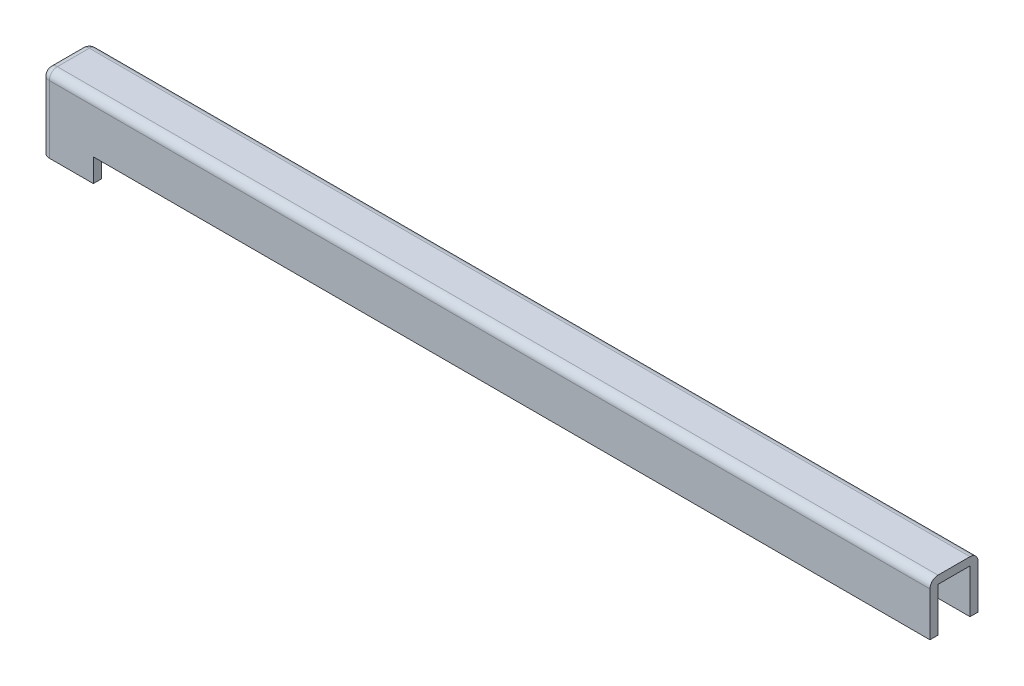
ISO-10303-21;
HEADER;
FILE_DESCRIPTION(('STEP AP214'),'2;1');
FILE_NAME('part.step','',(''),(''),'','','');
FILE_SCHEMA(('AUTOMOTIVE_DESIGN { 1 0 10303 214 1 1 1 1 }'));
ENDSEC;
DATA;
#1=APPLICATION_CONTEXT('core data for automotive mechanical design processes');
#2=APPLICATION_PROTOCOL_DEFINITION('international standard','automotive_design',2000,#1);
#3=PRODUCT_CONTEXT('',#1,'mechanical');
#4=PRODUCT('Part','Part','',(#3));
#5=PRODUCT_RELATED_PRODUCT_CATEGORY('part','',(#4));
#6=PRODUCT_DEFINITION_FORMATION('','',#4);
#7=PRODUCT_DEFINITION_CONTEXT('part definition',#1,'design');
#8=PRODUCT_DEFINITION('design','',#6,#7);
#9=PRODUCT_DEFINITION_SHAPE('','',#8);
#10=(LENGTH_UNIT() NAMED_UNIT(*) SI_UNIT(.MILLI.,.METRE.));
#11=(NAMED_UNIT(*) PLANE_ANGLE_UNIT() SI_UNIT($,.RADIAN.));
#12=(NAMED_UNIT(*) SI_UNIT($,.STERADIAN.) SOLID_ANGLE_UNIT());
#13=UNCERTAINTY_MEASURE_WITH_UNIT(LENGTH_MEASURE(1.E-05),#10,'distance_accuracy_value','');
#14=(GEOMETRIC_REPRESENTATION_CONTEXT(3) GLOBAL_UNCERTAINTY_ASSIGNED_CONTEXT((#13)) GLOBAL_UNIT_ASSIGNED_CONTEXT((#10,
#11,#12)) REPRESENTATION_CONTEXT('',''));
#15=CARTESIAN_POINT('',(0.,0.,0.));
#16=DIRECTION('',(0.,0.,1.));
#17=DIRECTION('',(1.,0.,0.));
#18=AXIS2_PLACEMENT_3D('',#15,#16,#17);
#19=CARTESIAN_POINT('',(220.,0.,0.));
#20=DIRECTION('',(0.,-1.,0.));
#21=DIRECTION('',(0.,0.,-1.));
#22=AXIS2_PLACEMENT_3D('',#19,#20,#21);
#23=PLANE('',#22);
#24=DIRECTION('',(-1.,0.,0.));
#25=VECTOR('',#24,1.);
#26=CARTESIAN_POINT('',(220.,0.,-8.));
#27=LINE('',#26,#25);
#28=CARTESIAN_POINT('',(220.,0.,-8.));
#29=VERTEX_POINT('',#28);
#30=CARTESIAN_POINT('',(11.,0.,-8.));
#31=VERTEX_POINT('',#30);
#32=EDGE_CURVE('E241',#29,#31,#27,.T.);
#33=ORIENTED_EDGE('',*,*,#32,.T.);
#34=DIRECTION('',(0.,0.,-1.));
#35=VECTOR('',#34,1.);
#36=CARTESIAN_POINT('',(11.,0.,0.));
#37=LINE('',#36,#35);
#38=CARTESIAN_POINT('',(11.,0.,-10.));
#39=VERTEX_POINT('',#38);
#40=EDGE_CURVE('E158',#31,#39,#37,.T.);
#41=ORIENTED_EDGE('',*,*,#40,.T.);
#42=DIRECTION('',(-1.,0.,0.));
#43=VECTOR('',#42,1.);
#44=CARTESIAN_POINT('',(220.,0.,-10.));
#45=LINE('',#44,#43);
#46=CARTESIAN_POINT('',(220.,0.,-10.));
#47=VERTEX_POINT('',#46);
#48=EDGE_CURVE('E238',#47,#39,#45,.T.);
#49=ORIENTED_EDGE('',*,*,#48,.F.);
#50=DIRECTION('',(0.,0.,-1.));
#51=VECTOR('',#50,1.);
#52=CARTESIAN_POINT('',(220.,0.,0.));
#53=LINE('',#52,#51);
#54=EDGE_CURVE('E204',#29,#47,#53,.T.);
#55=ORIENTED_EDGE('',*,*,#54,.F.);
#56=EDGE_LOOP('',(#33,#41,#49,#55));
#57=FACE_BOUND('',#56,.T.);
#58=ADVANCED_FACE('F38',(#57),#23,.T.);
#59=CARTESIAN_POINT('',(220.,0.,-8.));
#60=DIRECTION('',(0.,0.,1.));
#61=DIRECTION('',(1.,0.,0.));
#62=AXIS2_PLACEMENT_3D('',#59,#60,#61);
#63=PLANE('',#62);
#64=DIRECTION('',(0.,1.,0.));
#65=VECTOR('',#64,1.);
#66=CARTESIAN_POINT('',(0.,0.,-8.));
#67=LINE('',#66,#65);
#68=CARTESIAN_POINT('',(0.,-5.8,-8.));
#69=VERTEX_POINT('',#68);
#70=CARTESIAN_POINT('',(0.,11.,-8.));
#71=VERTEX_POINT('',#70);
#72=EDGE_CURVE('E160',#69,#71,#67,.T.);
#73=ORIENTED_EDGE('',*,*,#72,.F.);
#74=DIRECTION('',(-1.,0.,0.));
#75=VECTOR('',#74,1.);
#76=CARTESIAN_POINT('',(0.,-5.8,-8.));
#77=LINE('',#76,#75);
#78=CARTESIAN_POINT('',(11.,-5.8,-8.));
#79=VERTEX_POINT('',#78);
#80=EDGE_CURVE('E164',#79,#69,#77,.T.);
#81=ORIENTED_EDGE('',*,*,#80,.F.);
#82=DIRECTION('',(0.,1.,0.));
#83=VECTOR('',#82,1.);
#84=CARTESIAN_POINT('',(11.,-5.8,-8.));
#85=LINE('',#84,#83);
#86=EDGE_CURVE('E152',#79,#31,#85,.T.);
#87=ORIENTED_EDGE('',*,*,#86,.T.);
#88=ORIENTED_EDGE('',*,*,#32,.F.);
#89=DIRECTION('',(0.,1.,0.));
#90=VECTOR('',#89,1.);
#91=CARTESIAN_POINT('',(220.,0.,-8.));
#92=LINE('',#91,#90);
#93=CARTESIAN_POINT('',(220.,11.,-8.));
#94=VERTEX_POINT('',#93);
#95=EDGE_CURVE('E201',#29,#94,#92,.T.);
#96=ORIENTED_EDGE('',*,*,#95,.T.);
#97=DIRECTION('',(-1.,0.,0.));
#98=VECTOR('',#97,1.);
#99=CARTESIAN_POINT('',(220.,11.,-8.));
#100=LINE('',#99,#98);
#101=EDGE_CURVE('E222',#94,#71,#100,.T.);
#102=ORIENTED_EDGE('',*,*,#101,.T.);
#103=EDGE_LOOP('',(#73,#81,#87,#88,#96,#102));
#104=FACE_BOUND('',#103,.T.);
#105=ADVANCED_FACE('F165',(#104),#63,.T.);
#106=CARTESIAN_POINT('',(220.,0.,-10.));
#107=DIRECTION('',(0.,0.,1.));
#108=DIRECTION('',(1.,0.,0.));
#109=AXIS2_PLACEMENT_3D('',#106,#107,#108);
#110=PLANE('',#109);
#111=DIRECTION('',(1.,0.,0.));
#112=VECTOR('',#111,1.);
#113=CARTESIAN_POINT('',(0.,-5.8,-10.));
#114=LINE('',#113,#112);
#115=CARTESIAN_POINT('',(0.,-5.8,-10.));
#116=VERTEX_POINT('',#115);
#117=CARTESIAN_POINT('',(11.,-5.8,-10.));
#118=VERTEX_POINT('',#117);
#119=EDGE_CURVE('E175',#116,#118,#114,.T.);
#120=ORIENTED_EDGE('',*,*,#119,.F.);
#121=DIRECTION('',(0.,-1.,0.));
#122=VECTOR('',#121,1.);
#123=CARTESIAN_POINT('',(0.,0.,-10.));
#124=LINE('',#123,#122);
#125=CARTESIAN_POINT('',(0.,11.,-10.));
#126=VERTEX_POINT('',#125);
#127=EDGE_CURVE('E256',#116,#126,#124,.F.);
#128=ORIENTED_EDGE('',*,*,#127,.T.);
#129=DIRECTION('',(-1.,0.,0.));
#130=VECTOR('',#129,1.);
#131=CARTESIAN_POINT('',(220.,11.,-10.));
#132=LINE('',#131,#130);
#133=CARTESIAN_POINT('',(220.,11.,-10.));
#134=VERTEX_POINT('',#133);
#135=EDGE_CURVE('E254',#126,#134,#132,.F.);
#136=ORIENTED_EDGE('',*,*,#135,.T.);
#137=DIRECTION('',(0.,1.,0.));
#138=VECTOR('',#137,1.);
#139=CARTESIAN_POINT('',(220.,0.,-10.));
#140=LINE('',#139,#138);
#141=EDGE_CURVE('E207',#47,#134,#140,.T.);
#142=ORIENTED_EDGE('',*,*,#141,.F.);
#143=ORIENTED_EDGE('',*,*,#48,.T.);
#144=DIRECTION('',(0.,1.,0.));
#145=VECTOR('',#144,1.);
#146=CARTESIAN_POINT('',(11.,-5.8,-10.));
#147=LINE('',#146,#145);
#148=EDGE_CURVE('E193',#118,#39,#147,.T.);
#149=ORIENTED_EDGE('',*,*,#148,.F.);
#150=EDGE_LOOP('',(#120,#128,#136,#142,#143,#149));
#151=FACE_BOUND('',#150,.T.);
#152=ADVANCED_FACE('F343',(#151),#110,.F.);
#153=CARTESIAN_POINT('',(220.,13.,0.));
#154=DIRECTION('',(0.,1.,0.));
#155=DIRECTION('',(0.,0.,1.));
#156=AXIS2_PLACEMENT_3D('',#153,#154,#155);
#157=PLANE('',#156);
#158=DIRECTION('',(0.,0.,-1.));
#159=VECTOR('',#158,1.);
#160=CARTESIAN_POINT('',(220.,13.,0.));
#161=LINE('',#160,#159);
#162=CARTESIAN_POINT('',(220.,13.,0.));
#163=VERTEX_POINT('',#162);
#164=CARTESIAN_POINT('',(220.,13.,-8.));
#165=VERTEX_POINT('',#164);
#166=EDGE_CURVE('E210',#163,#165,#161,.T.);
#167=ORIENTED_EDGE('',*,*,#166,.T.);
#168=DIRECTION('',(-1.,0.,0.));
#169=VECTOR('',#168,1.);
#170=CARTESIAN_POINT('',(-2.,13.,-8.));
#171=LINE('',#170,#169);
#172=CARTESIAN_POINT('',(0.,13.,-8.));
#173=VERTEX_POINT('',#172);
#174=EDGE_CURVE('E55',#165,#173,#171,.T.);
#175=ORIENTED_EDGE('',*,*,#174,.T.);
#176=DIRECTION('',(0.,0.,-1.));
#177=VECTOR('',#176,1.);
#178=CARTESIAN_POINT('',(0.,13.,2.));
#179=LINE('',#178,#177);
#180=CARTESIAN_POINT('',(0.,13.,0.));
#181=VERTEX_POINT('',#180);
#182=EDGE_CURVE('E59',#173,#181,#179,.F.);
#183=ORIENTED_EDGE('',*,*,#182,.T.);
#184=DIRECTION('',(-1.,0.,0.));
#185=VECTOR('',#184,1.);
#186=CARTESIAN_POINT('',(220.,13.,0.));
#187=LINE('',#186,#185);
#188=EDGE_CURVE('E262',#181,#163,#187,.F.);
#189=ORIENTED_EDGE('',*,*,#188,.T.);
#190=EDGE_LOOP('',(#167,#175,#183,#189));
#191=FACE_BOUND('',#190,.T.);
#192=ADVANCED_FACE('F345',(#191),#157,.T.);
#193=CARTESIAN_POINT('',(220.,0.,2.));
#194=DIRECTION('',(0.,0.,1.));
#195=DIRECTION('',(1.,0.,0.));
#196=AXIS2_PLACEMENT_3D('',#193,#194,#195);
#197=PLANE('',#196);
#198=DIRECTION('',(-1.,0.,0.));
#199=VECTOR('',#198,1.);
#200=CARTESIAN_POINT('',(220.,11.,2.));
#201=LINE('',#200,#199);
#202=CARTESIAN_POINT('',(220.,11.,2.));
#203=VERTEX_POINT('',#202);
#204=CARTESIAN_POINT('',(0.,11.,2.));
#205=VERTEX_POINT('',#204);
#206=EDGE_CURVE('E258',#203,#205,#201,.T.);
#207=ORIENTED_EDGE('',*,*,#206,.T.);
#208=DIRECTION('',(0.,1.,0.));
#209=VECTOR('',#208,1.);
#210=CARTESIAN_POINT('',(0.,-5.8,2.));
#211=LINE('',#210,#209);
#212=CARTESIAN_POINT('',(0.,-5.8,2.));
#213=VERTEX_POINT('',#212);
#214=EDGE_CURVE('E260',#205,#213,#211,.F.);
#215=ORIENTED_EDGE('',*,*,#214,.T.);
#216=DIRECTION('',(-1.,0.,0.));
#217=VECTOR('',#216,1.);
#218=CARTESIAN_POINT('',(0.,-5.8,2.));
#219=LINE('',#218,#217);
#220=CARTESIAN_POINT('',(11.,-5.8,2.));
#221=VERTEX_POINT('',#220);
#222=EDGE_CURVE('E187',#221,#213,#219,.T.);
#223=ORIENTED_EDGE('',*,*,#222,.F.);
#224=DIRECTION('',(0.,1.,0.));
#225=VECTOR('',#224,1.);
#226=CARTESIAN_POINT('',(11.,-5.8,2.));
#227=LINE('',#226,#225);
#228=CARTESIAN_POINT('',(11.,0.,2.));
#229=VERTEX_POINT('',#228);
#230=EDGE_CURVE('E196',#221,#229,#227,.T.);
#231=ORIENTED_EDGE('',*,*,#230,.T.);
#232=DIRECTION('',(-1.,0.,0.));
#233=VECTOR('',#232,1.);
#234=CARTESIAN_POINT('',(220.,0.,2.));
#235=LINE('',#234,#233);
#236=CARTESIAN_POINT('',(220.,0.,2.));
#237=VERTEX_POINT('',#236);
#238=EDGE_CURVE('E236',#237,#229,#235,.T.);
#239=ORIENTED_EDGE('',*,*,#238,.F.);
#240=DIRECTION('',(0.,1.,0.));
#241=VECTOR('',#240,1.);
#242=CARTESIAN_POINT('',(220.,0.,2.));
#243=LINE('',#242,#241);
#244=EDGE_CURVE('E212',#237,#203,#243,.T.);
#245=ORIENTED_EDGE('',*,*,#244,.T.);
#246=EDGE_LOOP('',(#207,#215,#223,#231,#239,#245));
#247=FACE_BOUND('',#246,.T.);
#248=ADVANCED_FACE('F305',(#247),#197,.T.);
#249=DIRECTION('',(0.,0.,1.));
#250=VECTOR('',#249,1.);
#251=CARTESIAN_POINT('',(11.,0.,0.));
#252=LINE('',#251,#250);
#253=CARTESIAN_POINT('',(11.,0.,0.));
#254=VERTEX_POINT('',#253);
#255=EDGE_CURVE('E177',#254,#229,#252,.T.);
#256=ORIENTED_EDGE('',*,*,#255,.F.);
#257=DIRECTION('',(-1.,0.,0.));
#258=VECTOR('',#257,1.);
#259=CARTESIAN_POINT('',(220.,0.,0.));
#260=LINE('',#259,#258);
#261=CARTESIAN_POINT('',(220.,0.,0.));
#262=VERTEX_POINT('',#261);
#263=EDGE_CURVE('E233',#262,#254,#260,.T.);
#264=ORIENTED_EDGE('',*,*,#263,.F.);
#265=DIRECTION('',(0.,0.,1.));
#266=VECTOR('',#265,1.);
#267=CARTESIAN_POINT('',(220.,0.,0.));
#268=LINE('',#267,#266);
#269=EDGE_CURVE('E215',#262,#237,#268,.T.);
#270=ORIENTED_EDGE('',*,*,#269,.T.);
#271=ORIENTED_EDGE('',*,*,#238,.T.);
#272=EDGE_LOOP('',(#256,#264,#270,#271));
#273=FACE_BOUND('',#272,.T.);
#274=ADVANCED_FACE('F319',(#273),#23,.T.);
#275=CARTESIAN_POINT('',(220.,0.,0.));
#276=DIRECTION('',(0.,0.,1.));
#277=DIRECTION('',(1.,0.,0.));
#278=AXIS2_PLACEMENT_3D('',#275,#276,#277);
#279=PLANE('',#278);
#280=DIRECTION('',(0.,1.,0.));
#281=VECTOR('',#280,1.);
#282=CARTESIAN_POINT('',(0.,0.,0.));
#283=LINE('',#282,#281);
#284=CARTESIAN_POINT('',(0.,-5.8,0.));
#285=VERTEX_POINT('',#284);
#286=CARTESIAN_POINT('',(0.,11.,0.));
#287=VERTEX_POINT('',#286);
#288=EDGE_CURVE('E224',#285,#287,#283,.T.);
#289=ORIENTED_EDGE('',*,*,#288,.T.);
#290=DIRECTION('',(-1.,0.,0.));
#291=VECTOR('',#290,1.);
#292=CARTESIAN_POINT('',(220.,11.,0.));
#293=LINE('',#292,#291);
#294=CARTESIAN_POINT('',(220.,11.,0.));
#295=VERTEX_POINT('',#294);
#296=EDGE_CURVE('E230',#295,#287,#293,.T.);
#297=ORIENTED_EDGE('',*,*,#296,.F.);
#298=DIRECTION('',(0.,1.,0.));
#299=VECTOR('',#298,1.);
#300=CARTESIAN_POINT('',(220.,0.,0.));
#301=LINE('',#300,#299);
#302=EDGE_CURVE('E218',#262,#295,#301,.T.);
#303=ORIENTED_EDGE('',*,*,#302,.F.);
#304=ORIENTED_EDGE('',*,*,#263,.T.);
#305=DIRECTION('',(0.,1.,0.));
#306=VECTOR('',#305,1.);
#307=CARTESIAN_POINT('',(11.,-5.8,0.));
#308=LINE('',#307,#306);
#309=CARTESIAN_POINT('',(11.,-5.8,0.));
#310=VERTEX_POINT('',#309);
#311=EDGE_CURVE('E161',#310,#254,#308,.T.);
#312=ORIENTED_EDGE('',*,*,#311,.F.);
#313=DIRECTION('',(1.,0.,0.));
#314=VECTOR('',#313,1.);
#315=CARTESIAN_POINT('',(0.,-5.8,0.));
#316=LINE('',#315,#314);
#317=EDGE_CURVE('E183',#285,#310,#316,.T.);
#318=ORIENTED_EDGE('',*,*,#317,.F.);
#319=EDGE_LOOP('',(#289,#297,#303,#304,#312,#318));
#320=FACE_BOUND('',#319,.T.);
#321=ADVANCED_FACE('F323',(#320),#279,.F.);
#322=CARTESIAN_POINT('',(220.,11.,0.));
#323=DIRECTION('',(0.,1.,0.));
#324=DIRECTION('',(0.,0.,1.));
#325=AXIS2_PLACEMENT_3D('',#322,#323,#324);
#326=PLANE('',#325);
#327=DIRECTION('',(0.,0.,-1.));
#328=VECTOR('',#327,1.);
#329=CARTESIAN_POINT('',(0.,11.,0.));
#330=LINE('',#329,#328);
#331=EDGE_CURVE('E205',#287,#71,#330,.T.);
#332=ORIENTED_EDGE('',*,*,#331,.T.);
#333=ORIENTED_EDGE('',*,*,#101,.F.);
#334=DIRECTION('',(0.,0.,-1.));
#335=VECTOR('',#334,1.);
#336=CARTESIAN_POINT('',(220.,11.,0.));
#337=LINE('',#336,#335);
#338=EDGE_CURVE('E220',#295,#94,#337,.T.);
#339=ORIENTED_EDGE('',*,*,#338,.F.);
#340=ORIENTED_EDGE('',*,*,#296,.T.);
#341=EDGE_LOOP('',(#332,#333,#339,#340));
#342=FACE_BOUND('',#341,.T.);
#343=ADVANCED_FACE('F328',(#342),#326,.F.);
#344=CARTESIAN_POINT('',(220.,0.,0.));
#345=DIRECTION('',(1.,0.,0.));
#346=DIRECTION('',(0.,0.,-1.));
#347=AXIS2_PLACEMENT_3D('',#344,#345,#346);
#348=PLANE('',#347);
#349=ORIENTED_EDGE('',*,*,#141,.T.);
#350=CARTESIAN_POINT('',(220.,11.,-8.));
#351=DIRECTION('',(1.,0.,0.));
#352=DIRECTION('',(0.,0.,-1.));
#353=AXIS2_PLACEMENT_3D('',#350,#351,#352);
#354=CIRCLE('',#353,2.);
#355=EDGE_CURVE('E11',#134,#165,#354,.T.);
#356=ORIENTED_EDGE('',*,*,#355,.T.);
#357=ORIENTED_EDGE('',*,*,#166,.F.);
#358=CARTESIAN_POINT('',(220.,11.,0.));
#359=DIRECTION('',(1.,0.,0.));
#360=DIRECTION('',(0.,0.,-1.));
#361=AXIS2_PLACEMENT_3D('',#358,#359,#360);
#362=CIRCLE('',#361,2.);
#363=EDGE_CURVE('E47',#163,#203,#362,.T.);
#364=ORIENTED_EDGE('',*,*,#363,.T.);
#365=ORIENTED_EDGE('',*,*,#244,.F.);
#366=ORIENTED_EDGE('',*,*,#269,.F.);
#367=ORIENTED_EDGE('',*,*,#302,.T.);
#368=ORIENTED_EDGE('',*,*,#338,.T.);
#369=ORIENTED_EDGE('',*,*,#95,.F.);
#370=ORIENTED_EDGE('',*,*,#54,.T.);
#371=EDGE_LOOP('',(#349,#356,#357,#364,#365,#366,#367,#368,#369,#370));
#372=FACE_BOUND('',#371,.T.);
#373=ADVANCED_FACE('F316',(#372),#348,.T.);
#374=CARTESIAN_POINT('',(-2.,0.,0.));
#375=DIRECTION('',(1.,0.,0.));
#376=DIRECTION('',(0.,0.,-1.));
#377=AXIS2_PLACEMENT_3D('',#374,#375,#376);
#378=PLANE('',#377);
#379=DIRECTION('',(0.,0.,-1.));
#380=VECTOR('',#379,1.);
#381=CARTESIAN_POINT('',(-2.,11.,-10.));
#382=LINE('',#381,#380);
#383=CARTESIAN_POINT('',(-2.,11.,0.));
#384=VERTEX_POINT('',#383);
#385=CARTESIAN_POINT('',(-2.,11.,-8.));
#386=VERTEX_POINT('',#385);
#387=EDGE_CURVE('E243',#384,#386,#382,.T.);
#388=ORIENTED_EDGE('',*,*,#387,.T.);
#389=DIRECTION('',(0.,-1.,0.));
#390=VECTOR('',#389,1.);
#391=CARTESIAN_POINT('',(-2.,0.,-8.));
#392=LINE('',#391,#390);
#393=CARTESIAN_POINT('',(-2.,-5.8,-8.));
#394=VERTEX_POINT('',#393);
#395=EDGE_CURVE('E247',#386,#394,#392,.T.);
#396=ORIENTED_EDGE('',*,*,#395,.T.);
#397=DIRECTION('',(0.,0.,-1.));
#398=VECTOR('',#397,1.);
#399=CARTESIAN_POINT('',(-2.,-5.8,0.));
#400=LINE('',#399,#398);
#401=CARTESIAN_POINT('',(-2.,-5.8,0.));
#402=VERTEX_POINT('',#401);
#403=EDGE_CURVE('E190',#402,#394,#400,.T.);
#404=ORIENTED_EDGE('',*,*,#403,.F.);
#405=DIRECTION('',(0.,1.,0.));
#406=VECTOR('',#405,1.);
#407=CARTESIAN_POINT('',(-2.,13.,0.));
#408=LINE('',#407,#406);
#409=EDGE_CURVE('E245',#402,#384,#408,.T.);
#410=ORIENTED_EDGE('',*,*,#409,.T.);
#411=EDGE_LOOP('',(#388,#396,#404,#410));
#412=FACE_BOUND('',#411,.T.);
#413=ADVANCED_FACE('F295',(#412),#378,.F.);
#414=CARTESIAN_POINT('',(0.,0.,0.));
#415=DIRECTION('',(1.,0.,0.));
#416=DIRECTION('',(0.,0.,-1.));
#417=AXIS2_PLACEMENT_3D('',#414,#415,#416);
#418=PLANE('',#417);
#419=ORIENTED_EDGE('',*,*,#288,.F.);
#420=DIRECTION('',(0.,0.,1.));
#421=VECTOR('',#420,1.);
#422=CARTESIAN_POINT('',(0.,-5.8,0.));
#423=LINE('',#422,#421);
#424=EDGE_CURVE('E170',#69,#285,#423,.T.);
#425=ORIENTED_EDGE('',*,*,#424,.F.);
#426=ORIENTED_EDGE('',*,*,#72,.T.);
#427=ORIENTED_EDGE('',*,*,#331,.F.);
#428=EDGE_LOOP('',(#419,#425,#426,#427));
#429=FACE_BOUND('',#428,.T.);
#430=ADVANCED_FACE('F399',(#429),#418,.T.);
#431=CARTESIAN_POINT('',(11.,-5.8,0.));
#432=DIRECTION('',(1.,0.,0.));
#433=DIRECTION('',(0.,0.,-1.));
#434=AXIS2_PLACEMENT_3D('',#431,#432,#433);
#435=PLANE('',#434);
#436=ORIENTED_EDGE('',*,*,#40,.F.);
#437=ORIENTED_EDGE('',*,*,#86,.F.);
#438=DIRECTION('',(0.,0.,-1.));
#439=VECTOR('',#438,1.);
#440=CARTESIAN_POINT('',(11.,-5.8,0.));
#441=LINE('',#440,#439);
#442=EDGE_CURVE('E157',#79,#118,#441,.T.);
#443=ORIENTED_EDGE('',*,*,#442,.T.);
#444=ORIENTED_EDGE('',*,*,#148,.T.);
#445=EDGE_LOOP('',(#436,#437,#443,#444));
#446=FACE_BOUND('',#445,.T.);
#447=ADVANCED_FACE('F154',(#446),#435,.T.);
#448=CARTESIAN_POINT('',(11.,-5.8,0.));
#449=DIRECTION('',(-1.,0.,0.));
#450=DIRECTION('',(0.,0.,1.));
#451=AXIS2_PLACEMENT_3D('',#448,#449,#450);
#452=PLANE('',#451);
#453=ORIENTED_EDGE('',*,*,#255,.T.);
#454=ORIENTED_EDGE('',*,*,#230,.F.);
#455=DIRECTION('',(0.,0.,1.));
#456=VECTOR('',#455,1.);
#457=CARTESIAN_POINT('',(11.,-5.8,0.));
#458=LINE('',#457,#456);
#459=EDGE_CURVE('E185',#310,#221,#458,.T.);
#460=ORIENTED_EDGE('',*,*,#459,.F.);
#461=ORIENTED_EDGE('',*,*,#311,.T.);
#462=EDGE_LOOP('',(#453,#454,#460,#461));
#463=FACE_BOUND('',#462,.T.);
#464=ADVANCED_FACE('F311',(#463),#452,.F.);
#465=CARTESIAN_POINT('',(0.,-5.8,0.));
#466=DIRECTION('',(0.,-1.,0.));
#467=DIRECTION('',(0.,0.,-1.));
#468=AXIS2_PLACEMENT_3D('',#465,#466,#467);
#469=PLANE('',#468);
#470=ORIENTED_EDGE('',*,*,#403,.T.);
#471=CARTESIAN_POINT('',(0.,-5.8,-8.));
#472=DIRECTION('',(0.,-1.,0.));
#473=DIRECTION('',(0.,0.,-1.));
#474=AXIS2_PLACEMENT_3D('',#471,#472,#473);
#475=CIRCLE('',#474,2.);
#476=EDGE_CURVE('E252',#394,#116,#475,.T.);
#477=ORIENTED_EDGE('',*,*,#476,.T.);
#478=ORIENTED_EDGE('',*,*,#119,.T.);
#479=ORIENTED_EDGE('',*,*,#442,.F.);
#480=ORIENTED_EDGE('',*,*,#80,.T.);
#481=ORIENTED_EDGE('',*,*,#424,.T.);
#482=ORIENTED_EDGE('',*,*,#317,.T.);
#483=ORIENTED_EDGE('',*,*,#459,.T.);
#484=ORIENTED_EDGE('',*,*,#222,.T.);
#485=CARTESIAN_POINT('',(0.,-5.8,0.));
#486=DIRECTION('',(0.,-1.,0.));
#487=DIRECTION('',(0.,0.,-1.));
#488=AXIS2_PLACEMENT_3D('',#485,#486,#487);
#489=CIRCLE('',#488,2.);
#490=EDGE_CURVE('E250',#213,#402,#489,.T.);
#491=ORIENTED_EDGE('',*,*,#490,.T.);
#492=EDGE_LOOP('',(#470,#477,#478,#479,#480,#481,#482,#483,#484,#491));
#493=FACE_BOUND('',#492,.T.);
#494=ADVANCED_FACE('F173',(#493),#469,.T.);
#495=CARTESIAN_POINT('',(220.,11.,0.));
#496=DIRECTION('',(-1.,0.,0.));
#497=DIRECTION('',(0.,0.,1.));
#498=AXIS2_PLACEMENT_3D('',#495,#496,#497);
#499=CYLINDRICAL_SURFACE('',#498,2.);
#500=ORIENTED_EDGE('',*,*,#363,.F.);
#501=ORIENTED_EDGE('',*,*,#188,.F.);
#502=CARTESIAN_POINT('',(0.,11.,0.));
#503=DIRECTION('',(-1.,0.,0.));
#504=DIRECTION('',(0.,0.,1.));
#505=AXIS2_PLACEMENT_3D('',#502,#503,#504);
#506=CIRCLE('',#505,2.);
#507=EDGE_CURVE('E42',#205,#181,#506,.T.);
#508=ORIENTED_EDGE('',*,*,#507,.F.);
#509=ORIENTED_EDGE('',*,*,#206,.F.);
#510=EDGE_LOOP('',(#500,#501,#508,#509));
#511=FACE_BOUND('',#510,.T.);
#512=ADVANCED_FACE('F40',(#511),#499,.T.);
#513=CARTESIAN_POINT('',(0.,0.,0.));
#514=DIRECTION('',(0.,-1.,0.));
#515=DIRECTION('',(0.,0.,-1.));
#516=AXIS2_PLACEMENT_3D('',#513,#514,#515);
#517=CYLINDRICAL_SURFACE('',#516,2.);
#518=ORIENTED_EDGE('',*,*,#490,.F.);
#519=ORIENTED_EDGE('',*,*,#214,.F.);
#520=CARTESIAN_POINT('',(0.,11.,0.));
#521=DIRECTION('',(0.,1.,0.));
#522=DIRECTION('',(0.,0.,1.));
#523=AXIS2_PLACEMENT_3D('',#520,#521,#522);
#524=CIRCLE('',#523,2.);
#525=EDGE_CURVE('E278',#384,#205,#524,.T.);
#526=ORIENTED_EDGE('',*,*,#525,.F.);
#527=ORIENTED_EDGE('',*,*,#409,.F.);
#528=EDGE_LOOP('',(#518,#519,#526,#527));
#529=FACE_BOUND('',#528,.T.);
#530=ADVANCED_FACE('F302',(#529),#517,.T.);
#531=CARTESIAN_POINT('',(0.,11.,0.));
#532=DIRECTION('',(0.,0.,1.));
#533=DIRECTION('',(1.,0.,0.));
#534=AXIS2_PLACEMENT_3D('',#531,#532,#533);
#535=SPHERICAL_SURFACE('',#534,2.);
#536=ORIENTED_EDGE('',*,*,#525,.T.);
#537=ORIENTED_EDGE('',*,*,#507,.T.);
#538=CARTESIAN_POINT('',(0.,11.,0.));
#539=DIRECTION('',(0.,0.,1.));
#540=DIRECTION('',(1.,0.,0.));
#541=AXIS2_PLACEMENT_3D('',#538,#539,#540);
#542=CIRCLE('',#541,2.);
#543=EDGE_CURVE('E276',#384,#181,#542,.F.);
#544=ORIENTED_EDGE('',*,*,#543,.F.);
#545=EDGE_LOOP('',(#536,#537,#544));
#546=FACE_BOUND('',#545,.T.);
#547=ADVANCED_FACE('F285',(#546),#535,.T.);
#548=CARTESIAN_POINT('',(220.,11.,-8.));
#549=DIRECTION('',(1.,0.,0.));
#550=DIRECTION('',(0.,0.,-1.));
#551=AXIS2_PLACEMENT_3D('',#548,#549,#550);
#552=CYLINDRICAL_SURFACE('',#551,2.);
#553=ORIENTED_EDGE('',*,*,#355,.F.);
#554=ORIENTED_EDGE('',*,*,#135,.F.);
#555=CARTESIAN_POINT('',(0.,11.,-8.));
#556=DIRECTION('',(-1.,0.,0.));
#557=DIRECTION('',(0.,0.,1.));
#558=AXIS2_PLACEMENT_3D('',#555,#556,#557);
#559=CIRCLE('',#558,2.);
#560=EDGE_CURVE('E273',#173,#126,#559,.T.);
#561=ORIENTED_EDGE('',*,*,#560,.F.);
#562=ORIENTED_EDGE('',*,*,#174,.F.);
#563=EDGE_LOOP('',(#553,#554,#561,#562));
#564=FACE_BOUND('',#563,.T.);
#565=ADVANCED_FACE('F337',(#564),#552,.T.);
#566=CARTESIAN_POINT('',(0.,11.,0.));
#567=DIRECTION('',(0.,0.,1.));
#568=DIRECTION('',(1.,0.,0.));
#569=AXIS2_PLACEMENT_3D('',#566,#567,#568);
#570=CYLINDRICAL_SURFACE('',#569,2.);
#571=ORIENTED_EDGE('',*,*,#543,.T.);
#572=ORIENTED_EDGE('',*,*,#182,.F.);
#573=CARTESIAN_POINT('',(0.,11.,-8.));
#574=DIRECTION('',(0.,0.,-1.));
#575=DIRECTION('',(-1.,0.,0.));
#576=AXIS2_PLACEMENT_3D('',#573,#574,#575);
#577=CIRCLE('',#576,2.);
#578=EDGE_CURVE('E270',#386,#173,#577,.T.);
#579=ORIENTED_EDGE('',*,*,#578,.F.);
#580=ORIENTED_EDGE('',*,*,#387,.F.);
#581=EDGE_LOOP('',(#571,#572,#579,#580));
#582=FACE_BOUND('',#581,.T.);
#583=ADVANCED_FACE('F290',(#582),#570,.T.);
#584=CARTESIAN_POINT('',(0.,11.,-8.));
#585=DIRECTION('',(0.,1.,0.));
#586=DIRECTION('',(0.,0.,1.));
#587=AXIS2_PLACEMENT_3D('',#584,#585,#586);
#588=SPHERICAL_SURFACE('',#587,2.);
#589=ORIENTED_EDGE('',*,*,#578,.T.);
#590=ORIENTED_EDGE('',*,*,#560,.T.);
#591=CARTESIAN_POINT('',(0.,11.,-8.));
#592=DIRECTION('',(0.,1.,0.));
#593=DIRECTION('',(0.,0.,1.));
#594=AXIS2_PLACEMENT_3D('',#591,#592,#593);
#595=CIRCLE('',#594,2.);
#596=EDGE_CURVE('E267',#386,#126,#595,.F.);
#597=ORIENTED_EDGE('',*,*,#596,.F.);
#598=EDGE_LOOP('',(#589,#590,#597));
#599=FACE_BOUND('',#598,.T.);
#600=ADVANCED_FACE('F339',(#599),#588,.T.);
#601=CARTESIAN_POINT('',(0.,0.,-8.));
#602=DIRECTION('',(0.,-1.,0.));
#603=DIRECTION('',(0.,0.,-1.));
#604=AXIS2_PLACEMENT_3D('',#601,#602,#603);
#605=CYLINDRICAL_SURFACE('',#604,2.);
#606=ORIENTED_EDGE('',*,*,#596,.T.);
#607=ORIENTED_EDGE('',*,*,#127,.F.);
#608=ORIENTED_EDGE('',*,*,#476,.F.);
#609=ORIENTED_EDGE('',*,*,#395,.F.);
#610=EDGE_LOOP('',(#606,#607,#608,#609));
#611=FACE_BOUND('',#610,.T.);
#612=ADVANCED_FACE('F342',(#611),#605,.T.);
#613=CLOSED_SHELL('',(#58,#105,#152,#192,#248,#274,#321,#343,#373,#413,#430,#447,#464,#494,#512,
#530,#547,#565,#583,#600,#612));
#614=MANIFOLD_SOLID_BREP('B2',#613);
#615=ADVANCED_BREP_SHAPE_REPRESENTATION('',(#18,#614),#14);
#616=SHAPE_DEFINITION_REPRESENTATION(#9,#615);
ENDSEC;
END-ISO-10303-21;
